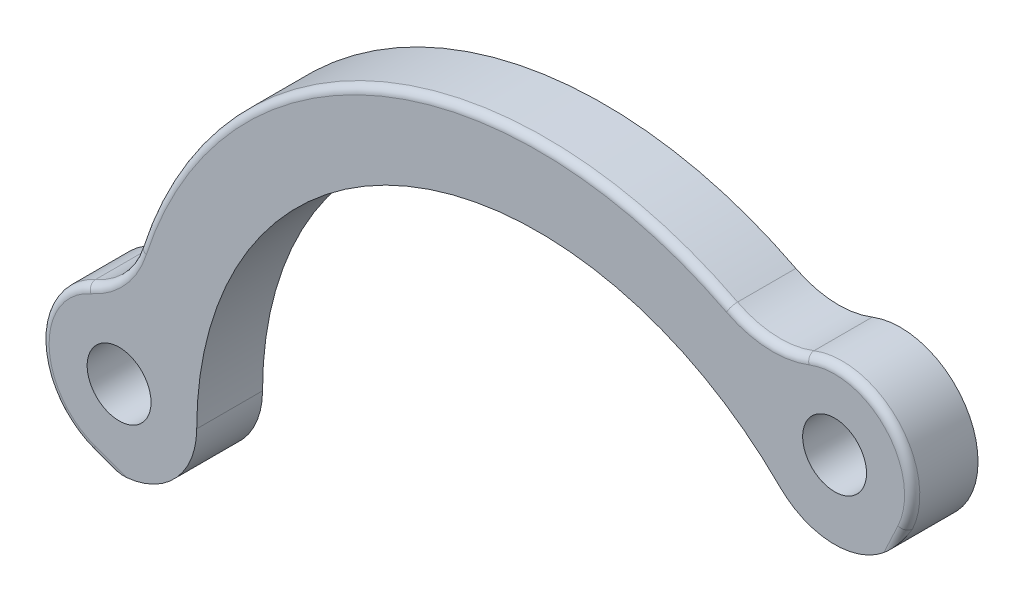
ISO-10303-21;
HEADER;
FILE_DESCRIPTION(('STEP AP214'),'2;1');
FILE_NAME('part.step','',(''),(''),'','','');
FILE_SCHEMA(('AUTOMOTIVE_DESIGN { 1 0 10303 214 1 1 1 1 }'));
ENDSEC;
DATA;
#1=APPLICATION_CONTEXT('core data for automotive mechanical design processes');
#2=APPLICATION_PROTOCOL_DEFINITION('international standard','automotive_design',2000,#1);
#3=PRODUCT_CONTEXT('',#1,'mechanical');
#4=PRODUCT('Part','Part','',(#3));
#5=PRODUCT_RELATED_PRODUCT_CATEGORY('part','',(#4));
#6=PRODUCT_DEFINITION_FORMATION('','',#4);
#7=PRODUCT_DEFINITION_CONTEXT('part definition',#1,'design');
#8=PRODUCT_DEFINITION('design','',#6,#7);
#9=PRODUCT_DEFINITION_SHAPE('','',#8);
#10=(LENGTH_UNIT() NAMED_UNIT(*) SI_UNIT(.MILLI.,.METRE.));
#11=(NAMED_UNIT(*) PLANE_ANGLE_UNIT() SI_UNIT($,.RADIAN.));
#12=(NAMED_UNIT(*) SI_UNIT($,.STERADIAN.) SOLID_ANGLE_UNIT());
#13=UNCERTAINTY_MEASURE_WITH_UNIT(LENGTH_MEASURE(1.E-05),#10,'distance_accuracy_value','');
#14=(GEOMETRIC_REPRESENTATION_CONTEXT(3) GLOBAL_UNCERTAINTY_ASSIGNED_CONTEXT((#13)) GLOBAL_UNIT_ASSIGNED_CONTEXT((#10,
#11,#12)) REPRESENTATION_CONTEXT('',''));
#15=CARTESIAN_POINT('',(0.,0.,0.));
#16=DIRECTION('',(0.,0.,1.));
#17=DIRECTION('',(1.,0.,0.));
#18=AXIS2_PLACEMENT_3D('',#15,#16,#17);
#19=CARTESIAN_POINT('',(42.8625,0.,6.731));
#20=DIRECTION('',(0.,0.,1.));
#21=DIRECTION('',(1.,0.,0.));
#22=AXIS2_PLACEMENT_3D('',#19,#20,#21);
#23=PLANE('',#22);
#24=CARTESIAN_POINT('',(0.,0.,6.731));
#25=DIRECTION('',(0.,0.,1.));
#26=DIRECTION('',(1.,0.,0.));
#27=AXIS2_PLACEMENT_3D('',#24,#25,#26);
#28=CIRCLE('',#27,7.9375);
#29=CARTESIAN_POINT('',(7.9375,0.,6.731));
#30=VERTEX_POINT('',#29);
#31=CARTESIAN_POINT('',(0.776396496338485,-7.89943762115211,6.731));
#32=VERTEX_POINT('',#31);
#33=EDGE_CURVE('E55',#30,#32,#28,.F.);
#34=ORIENTED_EDGE('',*,*,#33,.F.);
#35=CARTESIAN_POINT('',(42.8625,0.,6.731));
#36=DIRECTION('',(0.,0.,1.));
#37=DIRECTION('',(1.,0.,0.));
#38=AXIS2_PLACEMENT_3D('',#35,#36,#37);
#39=CIRCLE('',#38,34.925);
#40=CARTESIAN_POINT('',(67.5582043329403,24.69570433294,6.731));
#41=VERTEX_POINT('',#40);
#42=EDGE_CURVE('E140',#41,#30,#39,.T.);
#43=ORIENTED_EDGE('',*,*,#42,.F.);
#44=CARTESIAN_POINT('',(73.1708644086086,30.3083644086082,6.731));
#45=DIRECTION('',(0.,0.,1.));
#46=DIRECTION('',(1.,0.,0.));
#47=AXIS2_PLACEMENT_3D('',#44,#45,#46);
#48=CIRCLE('',#47,7.93750000000001);
#49=CARTESIAN_POINT('',(78.2076150906349,24.173623271681,6.731));
#50=VERTEX_POINT('',#49);
#51=EDGE_CURVE('E157',#50,#41,#48,.F.);
#52=ORIENTED_EDGE('',*,*,#51,.F.);
#53=DIRECTION('',(0.422618261740707,0.906307787036646,0.));
#54=VECTOR('',#53,1.);
#55=CARTESIAN_POINT('',(79.6577623943234,27.2834742001991,6.731));
#56=LINE('',#55,#54);
#57=CARTESIAN_POINT('',(79.6577623943234,27.2834742001991,6.731));
#58=VERTEX_POINT('',#57);
#59=EDGE_CURVE('E271',#50,#58,#56,.T.);
#60=ORIENTED_EDGE('',*,*,#59,.T.);
#61=CARTESIAN_POINT('',(73.1708644086086,30.3083644086082,6.731));
#62=DIRECTION('',(0.,0.,1.));
#63=DIRECTION('',(1.,0.,0.));
#64=AXIS2_PLACEMENT_3D('',#61,#62,#63);
#65=CIRCLE('',#64,7.15750000000002);
#66=CARTESIAN_POINT('',(70.5738738556035,36.9781055068521,6.731));
#67=VERTEX_POINT('',#66);
#68=EDGE_CURVE('E230',#58,#67,#65,.T.);
#69=ORIENTED_EDGE('',*,*,#68,.T.);
#70=CARTESIAN_POINT('',(66.834860562035,46.5808553521056,6.731));
#71=DIRECTION('',(0.,0.,1.));
#72=DIRECTION('',(1.,0.,0.));
#73=AXIS2_PLACEMENT_3D('',#70,#71,#72);
#74=CIRCLE('',#73,10.305);
#75=CARTESIAN_POINT('',(62.1193239246354,37.4180643350987,6.731));
#76=VERTEX_POINT('',#75);
#77=EDGE_CURVE('E268',#67,#76,#74,.F.);
#78=ORIENTED_EDGE('',*,*,#77,.T.);
#79=CARTESIAN_POINT('',(42.8625,0.,6.731));
#80=DIRECTION('',(0.,0.,1.));
#81=DIRECTION('',(1.,0.,0.));
#82=AXIS2_PLACEMENT_3D('',#79,#80,#81);
#83=CIRCLE('',#82,42.0825);
#84=CARTESIAN_POINT('',(2.78730218855219,12.841936248998,6.731));
#85=VERTEX_POINT('',#84);
#86=EDGE_CURVE('E266',#76,#85,#83,.T.);
#87=ORIENTED_EDGE('',*,*,#86,.T.);
#88=CARTESIAN_POINT('',(-7.0261574074074,15.9866199784799,6.731));
#89=DIRECTION('',(0.,0.,1.));
#90=DIRECTION('',(1.,0.,0.));
#91=AXIS2_PLACEMENT_3D('',#88,#89,#90);
#92=CIRCLE('',#91,10.305);
#93=CARTESIAN_POINT('',(-2.87986952861953,6.55256879003408,6.731));
#94=VERTEX_POINT('',#93);
#95=EDGE_CURVE('E264',#85,#94,#92,.F.);
#96=ORIENTED_EDGE('',*,*,#95,.T.);
#97=CARTESIAN_POINT('',(0.,0.,6.731));
#98=DIRECTION('',(0.,0.,1.));
#99=DIRECTION('',(1.,0.,0.));
#100=AXIS2_PLACEMENT_3D('',#97,#98,#99);
#101=CIRCLE('',#100,7.1575);
#102=CARTESIAN_POINT('',(-2.44800917585345,-6.72584993327515,6.731));
#103=VERTEX_POINT('',#102);
#104=EDGE_CURVE('E262',#94,#103,#101,.T.);
#105=ORIENTED_EDGE('',*,*,#104,.T.);
#106=DIRECTION('',(0.939692620785909,-0.342020143325666,0.));
#107=VECTOR('',#106,1.);
#108=CARTESIAN_POINT('',(15.8872000053329,-13.3993203142713,6.731));
#109=LINE('',#108,#107);
#110=EDGE_CURVE('E259',#103,#32,#109,.T.);
#111=ORIENTED_EDGE('',*,*,#110,.T.);
#112=EDGE_LOOP('',(#34,#43,#52,#60,#69,#78,#87,#96,#105,#111));
#113=FACE_BOUND('',#112,.T.);
#114=CARTESIAN_POINT('',(0.,0.,6.731));
#115=DIRECTION('',(0.,0.,1.));
#116=DIRECTION('',(1.,0.,0.));
#117=AXIS2_PLACEMENT_3D('',#114,#115,#116);
#118=CIRCLE('',#117,3.2639);
#119=CARTESIAN_POINT('',(3.2639,0.,6.731));
#120=VERTEX_POINT('',#119);
#121=EDGE_CURVE('E232',#120,#120,#118,.T.);
#122=ORIENTED_EDGE('',*,*,#121,.F.);
#123=EDGE_LOOP('',(#122));
#124=FACE_BOUND('',#123,.T.);
#125=CARTESIAN_POINT('',(73.1708644086086,30.3083644086082,6.731));
#126=DIRECTION('',(0.,0.,1.));
#127=DIRECTION('',(1.,0.,0.));
#128=AXIS2_PLACEMENT_3D('',#125,#126,#127);
#129=CIRCLE('',#128,3.2639);
#130=CARTESIAN_POINT('',(76.4347644086086,30.3083644086082,6.731));
#131=VERTEX_POINT('',#130);
#132=EDGE_CURVE('E290',#131,#131,#129,.T.);
#133=ORIENTED_EDGE('',*,*,#132,.F.);
#134=EDGE_LOOP('',(#133));
#135=FACE_BOUND('',#134,.T.);
#136=ADVANCED_FACE('F35',(#113,#124,#135),#23,.T.);
#137=CARTESIAN_POINT('',(42.8625,0.,0.));
#138=DIRECTION('',(0.,0.,1.));
#139=DIRECTION('',(1.,0.,0.));
#140=AXIS2_PLACEMENT_3D('',#137,#138,#139);
#141=PLANE('',#140);
#142=CARTESIAN_POINT('',(0.,0.,0.));
#143=DIRECTION('',(0.,0.,1.));
#144=DIRECTION('',(1.,0.,0.));
#145=AXIS2_PLACEMENT_3D('',#142,#143,#144);
#146=CIRCLE('',#145,3.2639);
#147=CARTESIAN_POINT('',(3.2639,0.,0.));
#148=VERTEX_POINT('',#147);
#149=EDGE_CURVE('E235',#148,#148,#146,.T.);
#150=ORIENTED_EDGE('',*,*,#149,.T.);
#151=EDGE_LOOP('',(#150));
#152=FACE_BOUND('',#151,.T.);
#153=CARTESIAN_POINT('',(73.1708644086086,30.3083644086082,0.));
#154=DIRECTION('',(0.,0.,1.));
#155=DIRECTION('',(1.,0.,0.));
#156=AXIS2_PLACEMENT_3D('',#153,#154,#155);
#157=CIRCLE('',#156,3.2639);
#158=CARTESIAN_POINT('',(76.4347644086086,30.3083644086082,0.));
#159=VERTEX_POINT('',#158);
#160=EDGE_CURVE('E287',#159,#159,#157,.T.);
#161=ORIENTED_EDGE('',*,*,#160,.T.);
#162=EDGE_LOOP('',(#161));
#163=FACE_BOUND('',#162,.T.);
#164=CARTESIAN_POINT('',(42.8625,0.,0.));
#165=DIRECTION('',(0.,0.,-1.));
#166=DIRECTION('',(-1.,0.,0.));
#167=AXIS2_PLACEMENT_3D('',#164,#165,#166);
#168=CIRCLE('',#167,34.925);
#169=CARTESIAN_POINT('',(7.9375,0.,0.));
#170=VERTEX_POINT('',#169);
#171=CARTESIAN_POINT('',(67.5582043329403,24.69570433294,0.));
#172=VERTEX_POINT('',#171);
#173=EDGE_CURVE('E138',#170,#172,#168,.T.);
#174=ORIENTED_EDGE('',*,*,#173,.F.);
#175=CARTESIAN_POINT('',(0.,0.,0.));
#176=DIRECTION('',(0.,0.,1.));
#177=DIRECTION('',(-1.,0.,0.));
#178=AXIS2_PLACEMENT_3D('',#175,#176,#177);
#179=CIRCLE('',#178,7.9375);
#180=CARTESIAN_POINT('',(-3.19370791245791,7.26664544476361,0.));
#181=VERTEX_POINT('',#180);
#182=EDGE_CURVE('E122',#181,#170,#179,.T.);
#183=ORIENTED_EDGE('',*,*,#182,.F.);
#184=CARTESIAN_POINT('',(-7.0261574074074,15.9866199784799,0.));
#185=DIRECTION('',(0.,0.,1.));
#186=DIRECTION('',(1.,0.,0.));
#187=AXIS2_PLACEMENT_3D('',#184,#185,#186);
#188=CIRCLE('',#187,9.525);
#189=CARTESIAN_POINT('',(2.04450757575757,13.0799618005745,0.));
#190=VERTEX_POINT('',#189);
#191=EDGE_CURVE('E273',#181,#190,#188,.T.);
#192=ORIENTED_EDGE('',*,*,#191,.T.);
#193=CARTESIAN_POINT('',(42.8625,0.,0.));
#194=DIRECTION('',(0.,0.,1.));
#195=DIRECTION('',(-1.,0.,0.));
#196=AXIS2_PLACEMENT_3D('',#193,#194,#195);
#197=CIRCLE('',#196,42.8625);
#198=CARTESIAN_POINT('',(62.4762495507559,38.1116089244501,0.));
#199=VERTEX_POINT('',#198);
#200=EDGE_CURVE('E132',#199,#190,#197,.T.);
#201=ORIENTED_EDGE('',*,*,#200,.F.);
#202=CARTESIAN_POINT('',(66.834860562035,46.5808553521056,0.));
#203=DIRECTION('',(0.,0.,1.));
#204=DIRECTION('',(1.,0.,0.));
#205=AXIS2_PLACEMENT_3D('',#202,#203,#204);
#206=CIRCLE('',#205,9.525);
#207=CARTESIAN_POINT('',(70.290862660166,37.7049512011071,0.));
#208=VERTEX_POINT('',#207);
#209=EDGE_CURVE('E275',#199,#208,#206,.T.);
#210=ORIENTED_EDGE('',*,*,#209,.T.);
#211=CARTESIAN_POINT('',(73.1708644086086,30.3083644086082,0.));
#212=DIRECTION('',(0.,0.,1.));
#213=DIRECTION('',(1.,0.,0.));
#214=AXIS2_PLACEMENT_3D('',#211,#212,#213);
#215=CIRCLE('',#214,7.93750000000002);
#216=EDGE_CURVE('E145',#172,#208,#215,.T.);
#217=ORIENTED_EDGE('',*,*,#216,.F.);
#218=EDGE_LOOP('',(#174,#183,#192,#201,#210,#217));
#219=FACE_BOUND('',#218,.T.);
#220=ADVANCED_FACE('F143',(#152,#163,#219),#141,.F.);
#221=CARTESIAN_POINT('',(73.1708644086086,30.3083644086082,6.731));
#222=DIRECTION('',(0.,0.,-1.));
#223=DIRECTION('',(-1.,0.,0.));
#224=AXIS2_PLACEMENT_3D('',#221,#222,#223);
#225=CYLINDRICAL_SURFACE('',#224,7.93750000000002);
#226=DIRECTION('',(0.,0.,-1.));
#227=VECTOR('',#226,1.);
#228=CARTESIAN_POINT('',(70.290862660166,37.7049512011071,6.731));
#229=LINE('',#228,#227);
#230=CARTESIAN_POINT('',(70.290862660166,37.7049512011071,5.951));
#231=VERTEX_POINT('',#230);
#232=EDGE_CURVE('E278',#208,#231,#229,.F.);
#233=ORIENTED_EDGE('',*,*,#232,.T.);
#234=CARTESIAN_POINT('',(73.1708644086086,30.3083644086082,5.951));
#235=DIRECTION('',(0.,0.,1.));
#236=DIRECTION('',(1.,0.,0.));
#237=AXIS2_PLACEMENT_3D('',#234,#235,#236);
#238=CIRCLE('',#237,7.93750000000002);
#239=CARTESIAN_POINT('',(80.364682468212,26.9538319560414,5.951));
#240=VERTEX_POINT('',#239);
#241=EDGE_CURVE('E228',#231,#240,#238,.F.);
#242=ORIENTED_EDGE('',*,*,#241,.T.);
#243=CARTESIAN_POINT('',(78.2076150906349,24.173623271681,6.731));
#244=CARTESIAN_POINT('',(78.2568085097883,24.2140102377211,6.73098779399788));
#245=CARTESIAN_POINT('',(78.3055019851384,24.2549809086841,6.72954464634177));
#246=CARTESIAN_POINT('',(78.4017918000833,24.3379927588243,6.72414057731396));
#247=CARTESIAN_POINT('',(78.44938859964,24.3800334730438,6.72018073216149));
#248=CARTESIAN_POINT('',(78.5433389259716,24.4650407654256,6.71009655524097));
#249=CARTESIAN_POINT('',(78.5896946820609,24.5080053927864,6.70397643027504));
#250=CARTESIAN_POINT('',(78.6812187969471,24.5948818574856,6.68983911060659));
#251=CARTESIAN_POINT('',(78.726387010419,24.6387938095664,6.68182168491231));
#252=CARTESIAN_POINT('',(78.8596888846366,24.7715008857033,6.6553574886065));
#253=CARTESIAN_POINT('',(78.9460201075267,24.8616299028774,6.63445162109685));
#254=CARTESIAN_POINT('',(79.1137541511226,25.0451485852694,6.58755339415589));
#255=CARTESIAN_POINT('',(79.1951538146437,25.138540280184,6.56155782042492));
#256=CARTESIAN_POINT('',(79.3835185653492,25.3650725304306,6.49481389951718));
#257=CARTESIAN_POINT('',(79.4881797458855,25.4996029953053,6.45225050388705));
#258=CARTESIAN_POINT('',(79.6878745475092,25.773908250953,6.36200064409832));
#259=CARTESIAN_POINT('',(79.7829068933494,25.9136837330279,6.31431350306729));
#260=CARTESIAN_POINT('',(80.0537247180363,26.3405353231946,6.16640500875739));
#261=CARTESIAN_POINT('',(80.215299930851,26.6352199804813,6.06130956762044));
#262=CARTESIAN_POINT('',(80.3598865861569,26.9435615264311,5.95455324014988));
#263=CARTESIAN_POINT('',(80.3622873058438,26.9486955242317,5.95277658745562));
#264=CARTESIAN_POINT('',(80.364682468212,26.9538319560414,5.951));
#265=B_SPLINE_CURVE_WITH_KNOTS('',3,(#243,#244,#245,#246,#247,#248,#249,#250,#251,#252,#253,
#254,#255,#256,#257,#258,#259,#260,#261,#262,#263,#264),.UNSPECIFIED.,.F.,.F.,(4,2,2,2,2,2,2,2,
2,2,4),(0.,0.190901062952404,0.381720545465926,0.572170468913945,0.762643591116576,
1.14196697846495,1.52153069694039,2.04805225414019,2.5746434531931,3.62749352862365,
3.64531206767867),.UNSPECIFIED.);
#266=EDGE_CURVE('E151',#240,#50,#265,.F.);
#267=ORIENTED_EDGE('',*,*,#266,.T.);
#268=ORIENTED_EDGE('',*,*,#51,.T.);
#269=DIRECTION('',(0.,0.,-1.));
#270=VECTOR('',#269,1.);
#271=CARTESIAN_POINT('',(67.5582043329403,24.69570433294,6.79434496638833));
#272=LINE('',#271,#270);
#273=EDGE_CURVE('E141',#41,#172,#272,.T.);
#274=ORIENTED_EDGE('',*,*,#273,.T.);
#275=ORIENTED_EDGE('',*,*,#216,.T.);
#276=EDGE_LOOP('',(#233,#242,#267,#268,#274,#275));
#277=FACE_BOUND('',#276,.T.);
#278=ADVANCED_FACE('F179',(#277),#225,.T.);
#279=CARTESIAN_POINT('',(42.8625,0.,6.731));
#280=DIRECTION('',(0.,0.,-1.));
#281=DIRECTION('',(-1.,0.,0.));
#282=AXIS2_PLACEMENT_3D('',#279,#280,#281);
#283=CYLINDRICAL_SURFACE('',#282,42.8625);
#284=DIRECTION('',(0.,0.,-1.));
#285=VECTOR('',#284,1.);
#286=CARTESIAN_POINT('',(2.04450757575757,13.0799618005745,6.731));
#287=LINE('',#286,#285);
#288=CARTESIAN_POINT('',(2.04450757575757,13.0799618005745,5.951));
#289=VERTEX_POINT('',#288);
#290=EDGE_CURVE('E131',#190,#289,#287,.F.);
#291=ORIENTED_EDGE('',*,*,#290,.T.);
#292=CARTESIAN_POINT('',(42.8625,0.,5.951));
#293=DIRECTION('',(0.,0.,1.));
#294=DIRECTION('',(1.,0.,0.));
#295=AXIS2_PLACEMENT_3D('',#292,#293,#294);
#296=CIRCLE('',#295,42.8625);
#297=CARTESIAN_POINT('',(62.4762495507559,38.1116089244501,5.951));
#298=VERTEX_POINT('',#297);
#299=EDGE_CURVE('E49',#289,#298,#296,.F.);
#300=ORIENTED_EDGE('',*,*,#299,.T.);
#301=DIRECTION('',(0.,0.,-1.));
#302=VECTOR('',#301,1.);
#303=CARTESIAN_POINT('',(62.4762495507559,38.1116089244501,6.731));
#304=LINE('',#303,#302);
#305=EDGE_CURVE('E281',#298,#199,#304,.T.);
#306=ORIENTED_EDGE('',*,*,#305,.T.);
#307=ORIENTED_EDGE('',*,*,#200,.T.);
#308=EDGE_LOOP('',(#291,#300,#306,#307));
#309=FACE_BOUND('',#308,.T.);
#310=ADVANCED_FACE('F183',(#309),#283,.T.);
#311=CARTESIAN_POINT('',(0.,0.,6.731));
#312=DIRECTION('',(0.,0.,-1.));
#313=DIRECTION('',(-1.,0.,0.));
#314=AXIS2_PLACEMENT_3D('',#311,#312,#313);
#315=CYLINDRICAL_SURFACE('',#314,7.9375);
#316=ORIENTED_EDGE('',*,*,#182,.T.);
#317=DIRECTION('',(0.,0.,-1.));
#318=VECTOR('',#317,1.);
#319=CARTESIAN_POINT('',(7.9375,0.,6.79434496638833));
#320=LINE('',#319,#318);
#321=EDGE_CURVE('E125',#30,#170,#320,.T.);
#322=ORIENTED_EDGE('',*,*,#321,.F.);
#323=ORIENTED_EDGE('',*,*,#33,.T.);
#324=CARTESIAN_POINT('',(0.776396496338492,-7.89943762115211,6.731));
#325=CARTESIAN_POINT('',(0.713053598506795,-7.90566472386674,6.73098779399788));
#326=CARTESIAN_POINT('',(0.649651472619264,-7.91112557121863,6.72954464634177));
#327=CARTESIAN_POINT('',(0.522866049359317,-7.92051451017244,6.72414057731393));
#328=CARTESIAN_POINT('',(0.459482755519331,-7.92444325579118,6.72018073216145));
#329=CARTESIAN_POINT('',(0.332940609781849,-7.9307669357415,6.71009655524089));
#330=CARTESIAN_POINT('',(0.269781560946025,-7.93316482586127,6.70397643027494));
#331=CARTESIAN_POINT('',(0.143633301353345,-7.93645121082505,6.68983911060644));
#332=CARTESIAN_POINT('',(0.0806441122216462,-7.93733952177365,6.68182168491214));
#333=CARTESIAN_POINT('',(-0.107452620430064,-7.93776010752993,6.6553574886063));
#334=CARTESIAN_POINT('',(-0.23222885278904,-7.9350746614382,6.63445162109668));
#335=CARTESIAN_POINT('',(-0.48060203724492,-7.92391323630687,6.58755339415582));
#336=CARTESIAN_POINT('',(-0.604198192087369,-7.91543358958833,6.56155782042495));
#337=CARTESIAN_POINT('',(-0.897574674954269,-7.88844509184195,6.49481389951711));
#338=CARTESIAN_POINT('',(-1.06670870942743,-7.86732431833702,6.45225050388668));
#339=CARTESIAN_POINT('',(-1.40187736420696,-7.81456676034916,6.36200064409877));
#340=CARTESIAN_POINT('',(-1.56791157160165,-7.78292858530601,6.31431350306888));
#341=CARTESIAN_POINT('',(-2.06123834586975,-7.6725960516417,6.16640500875447));
#342=CARTESIAN_POINT('',(-2.38386279399793,-7.5784734608172,6.06130956760404));
#343=CARTESIAN_POINT('',(-2.70413139650115,-7.46268126718847,5.95455324014933));
#344=CARTESIAN_POINT('',(-2.70945924633098,-7.46074854769945,5.95277658745534));
#345=CARTESIAN_POINT('',(-2.71478488764737,-7.45881017748819,5.951));
#346=B_SPLINE_CURVE_WITH_KNOTS('',3,(#324,#325,#326,#327,#328,#329,#330,#331,#332,#333,#334,
#335,#336,#337,#338,#339,#340,#341,#342,#343,#344,#345),.UNSPECIFIED.,.F.,.F.,(4,2,2,2,2,2,2,2,
2,2,4),(0.,0.190901062952808,0.38172054546674,0.572170468915073,0.76264359111804,
1.14196697846562,1.52153069694039,2.04805225414007,2.5746434531927,3.62749352862351,
3.64531206767856),.UNSPECIFIED.);
#347=CARTESIAN_POINT('',(-2.71478488764747,-7.45881017748816,5.951));
#348=VERTEX_POINT('',#347);
#349=EDGE_CURVE('E11',#32,#348,#346,.T.);
#350=ORIENTED_EDGE('',*,*,#349,.T.);
#351=CARTESIAN_POINT('',(0.,0.,5.951));
#352=DIRECTION('',(0.,0.,1.));
#353=DIRECTION('',(1.,0.,0.));
#354=AXIS2_PLACEMENT_3D('',#351,#352,#353);
#355=CIRCLE('',#354,7.9375);
#356=CARTESIAN_POINT('',(-3.19370791245791,7.26664544476361,5.951));
#357=VERTEX_POINT('',#356);
#358=EDGE_CURVE('E257',#348,#357,#355,.F.);
#359=ORIENTED_EDGE('',*,*,#358,.T.);
#360=DIRECTION('',(0.,0.,-1.));
#361=VECTOR('',#360,1.);
#362=CARTESIAN_POINT('',(-3.19370791245791,7.26664544476361,6.731));
#363=LINE('',#362,#361);
#364=EDGE_CURVE('E127',#357,#181,#363,.T.);
#365=ORIENTED_EDGE('',*,*,#364,.T.);
#366=EDGE_LOOP('',(#316,#322,#323,#350,#359,#365));
#367=FACE_BOUND('',#366,.T.);
#368=ADVANCED_FACE('F124',(#367),#315,.T.);
#369=CARTESIAN_POINT('',(73.1708644086086,30.3083644086082,6.731));
#370=DIRECTION('',(0.,0.,1.));
#371=DIRECTION('',(1.,0.,0.));
#372=AXIS2_PLACEMENT_3D('',#369,#370,#371);
#373=CYLINDRICAL_SURFACE('',#372,3.2639);
#374=ORIENTED_EDGE('',*,*,#160,.F.);
#375=EDGE_LOOP('',(#374));
#376=FACE_BOUND('',#375,.T.);
#377=ORIENTED_EDGE('',*,*,#132,.T.);
#378=EDGE_LOOP('',(#377));
#379=FACE_BOUND('',#378,.T.);
#380=ADVANCED_FACE('F169',(#376,#379),#373,.F.);
#381=CARTESIAN_POINT('',(0.,0.,6.731));
#382=DIRECTION('',(0.,0.,1.));
#383=DIRECTION('',(1.,0.,0.));
#384=AXIS2_PLACEMENT_3D('',#381,#382,#383);
#385=CYLINDRICAL_SURFACE('',#384,3.2639);
#386=ORIENTED_EDGE('',*,*,#149,.F.);
#387=EDGE_LOOP('',(#386));
#388=FACE_BOUND('',#387,.T.);
#389=ORIENTED_EDGE('',*,*,#121,.T.);
#390=EDGE_LOOP('',(#389));
#391=FACE_BOUND('',#390,.T.);
#392=ADVANCED_FACE('F165',(#388,#391),#385,.F.);
#393=CARTESIAN_POINT('',(66.834860562035,46.5808553521056,6.731));
#394=DIRECTION('',(0.,0.,1.));
#395=DIRECTION('',(1.,0.,0.));
#396=AXIS2_PLACEMENT_3D('',#393,#394,#395);
#397=CYLINDRICAL_SURFACE('',#396,9.525);
#398=ORIENTED_EDGE('',*,*,#305,.F.);
#399=CARTESIAN_POINT('',(66.834860562035,46.5808553521056,5.951));
#400=DIRECTION('',(0.,0.,1.));
#401=DIRECTION('',(1.,0.,0.));
#402=AXIS2_PLACEMENT_3D('',#399,#400,#401);
#403=CIRCLE('',#402,9.525);
#404=EDGE_CURVE('E253',#298,#231,#403,.T.);
#405=ORIENTED_EDGE('',*,*,#404,.T.);
#406=ORIENTED_EDGE('',*,*,#232,.F.);
#407=ORIENTED_EDGE('',*,*,#209,.F.);
#408=EDGE_LOOP('',(#398,#405,#406,#407));
#409=FACE_BOUND('',#408,.T.);
#410=ADVANCED_FACE('F168',(#409),#397,.F.);
#411=CARTESIAN_POINT('',(-7.0261574074074,15.9866199784799,6.731));
#412=DIRECTION('',(0.,0.,1.));
#413=DIRECTION('',(1.,0.,0.));
#414=AXIS2_PLACEMENT_3D('',#411,#412,#413);
#415=CYLINDRICAL_SURFACE('',#414,9.525);
#416=ORIENTED_EDGE('',*,*,#364,.F.);
#417=CARTESIAN_POINT('',(-7.0261574074074,15.9866199784799,5.951));
#418=DIRECTION('',(0.,0.,1.));
#419=DIRECTION('',(1.,0.,0.));
#420=AXIS2_PLACEMENT_3D('',#417,#418,#419);
#421=CIRCLE('',#420,9.525);
#422=EDGE_CURVE('E255',#357,#289,#421,.T.);
#423=ORIENTED_EDGE('',*,*,#422,.T.);
#424=ORIENTED_EDGE('',*,*,#290,.F.);
#425=ORIENTED_EDGE('',*,*,#191,.F.);
#426=EDGE_LOOP('',(#416,#423,#424,#425));
#427=FACE_BOUND('',#426,.T.);
#428=ADVANCED_FACE('F191',(#427),#415,.F.);
#429=CARTESIAN_POINT('',(62.6357236782581,-9.2204056275837,5.951));
#430=DIRECTION('',(-0.422618261740707,-0.906307787036646,0.));
#431=DIRECTION('',(0.906307787036646,-0.422618261740707,0.));
#432=AXIS2_PLACEMENT_3D('',#429,#430,#431);
#433=CYLINDRICAL_SURFACE('',#432,0.78);
#434=ORIENTED_EDGE('',*,*,#266,.F.);
#435=CARTESIAN_POINT('',(79.6577623943234,27.2834742001991,5.951));
#436=DIRECTION('',(0.422618261740708,0.906307787036646,0.));
#437=DIRECTION('',(-0.906307787036646,0.422618261740708,0.));
#438=AXIS2_PLACEMENT_3D('',#435,#436,#437);
#439=CIRCLE('',#438,0.78);
#440=EDGE_CURVE('E225',#58,#240,#439,.T.);
#441=ORIENTED_EDGE('',*,*,#440,.F.);
#442=ORIENTED_EDGE('',*,*,#59,.F.);
#443=EDGE_LOOP('',(#434,#441,#442));
#444=FACE_BOUND('',#443,.T.);
#445=ADVANCED_FACE('F37',(#444),#433,.T.);
#446=CARTESIAN_POINT('',(73.1708644086086,30.3083644086082,5.951));
#447=DIRECTION('',(0.,0.,1.));
#448=DIRECTION('',(1.,0.,0.));
#449=AXIS2_PLACEMENT_3D('',#446,#447,#448);
#450=TOROIDAL_SURFACE('',#449,7.15750000000002,0.78);
#451=ORIENTED_EDGE('',*,*,#440,.T.);
#452=ORIENTED_EDGE('',*,*,#241,.F.);
#453=CARTESIAN_POINT('',(70.5738738556035,36.9781055068521,5.951));
#454=DIRECTION('',(-0.931853454173081,-0.362834865945511,0.));
#455=DIRECTION('',(0.362834865945511,-0.931853454173081,0.));
#456=AXIS2_PLACEMENT_3D('',#453,#454,#455);
#457=CIRCLE('',#456,0.78);
#458=EDGE_CURVE('E233',#67,#231,#457,.T.);
#459=ORIENTED_EDGE('',*,*,#458,.F.);
#460=ORIENTED_EDGE('',*,*,#68,.F.);
#461=EDGE_LOOP('',(#451,#452,#459,#460));
#462=FACE_BOUND('',#461,.T.);
#463=ADVANCED_FACE('F213',(#462),#450,.T.);
#464=CARTESIAN_POINT('',(66.834860562035,46.5808553521056,5.951));
#465=DIRECTION('',(0.,0.,1.));
#466=DIRECTION('',(1.,0.,0.));
#467=AXIS2_PLACEMENT_3D('',#464,#465,#466);
#468=TOROIDAL_SURFACE('',#467,10.305,0.78);
#469=ORIENTED_EDGE('',*,*,#458,.T.);
#470=ORIENTED_EDGE('',*,*,#404,.F.);
#471=CARTESIAN_POINT('',(62.1193239246354,37.4180643350987,5.951));
#472=DIRECTION('',(-0.889159729937596,0.457596956564728,0.));
#473=DIRECTION('',(-0.457596956564728,-0.889159729937596,0.));
#474=AXIS2_PLACEMENT_3D('',#471,#472,#473);
#475=CIRCLE('',#474,0.78);
#476=EDGE_CURVE('E237',#76,#298,#475,.T.);
#477=ORIENTED_EDGE('',*,*,#476,.F.);
#478=ORIENTED_EDGE('',*,*,#77,.F.);
#479=EDGE_LOOP('',(#469,#470,#477,#478));
#480=FACE_BOUND('',#479,.T.);
#481=ADVANCED_FACE('F210',(#480),#468,.T.);
#482=CARTESIAN_POINT('',(42.8625,0.,5.951));
#483=DIRECTION('',(0.,0.,1.));
#484=DIRECTION('',(1.,0.,0.));
#485=AXIS2_PLACEMENT_3D('',#482,#483,#484);
#486=TOROIDAL_SURFACE('',#485,42.0825,0.78);
#487=ORIENTED_EDGE('',*,*,#476,.T.);
#488=ORIENTED_EDGE('',*,*,#299,.F.);
#489=CARTESIAN_POINT('',(2.78730218855219,12.841936248998,5.951));
#490=DIRECTION('',(-0.305160963559628,-0.952300785634119,0.));
#491=DIRECTION('',(0.952300785634119,-0.305160963559628,0.));
#492=AXIS2_PLACEMENT_3D('',#489,#490,#491);
#493=CIRCLE('',#492,0.78);
#494=EDGE_CURVE('E242',#85,#289,#493,.T.);
#495=ORIENTED_EDGE('',*,*,#494,.F.);
#496=ORIENTED_EDGE('',*,*,#86,.F.);
#497=EDGE_LOOP('',(#487,#488,#495,#496));
#498=FACE_BOUND('',#497,.T.);
#499=ADVANCED_FACE('F206',(#498),#486,.T.);
#500=CARTESIAN_POINT('',(-7.0261574074074,15.9866199784799,5.951));
#501=DIRECTION('',(0.,0.,1.));
#502=DIRECTION('',(1.,0.,0.));
#503=AXIS2_PLACEMENT_3D('',#500,#501,#502);
#504=TOROIDAL_SURFACE('',#503,10.305,0.78);
#505=ORIENTED_EDGE('',*,*,#494,.T.);
#506=ORIENTED_EDGE('',*,*,#422,.F.);
#507=CARTESIAN_POINT('',(-2.87986952861953,6.55256879003408,5.951));
#508=DIRECTION('',(-0.91548289067888,-0.402356902356902,0.));
#509=DIRECTION('',(0.402356902356902,-0.91548289067888,0.));
#510=AXIS2_PLACEMENT_3D('',#507,#508,#509);
#511=CIRCLE('',#510,0.78);
#512=EDGE_CURVE('E245',#94,#357,#511,.T.);
#513=ORIENTED_EDGE('',*,*,#512,.F.);
#514=ORIENTED_EDGE('',*,*,#95,.F.);
#515=EDGE_LOOP('',(#505,#506,#513,#514));
#516=FACE_BOUND('',#515,.T.);
#517=ADVANCED_FACE('F202',(#516),#504,.T.);
#518=CARTESIAN_POINT('',(0.,0.,5.951));
#519=DIRECTION('',(0.,0.,1.));
#520=DIRECTION('',(1.,0.,0.));
#521=AXIS2_PLACEMENT_3D('',#518,#519,#520);
#522=TOROIDAL_SURFACE('',#521,7.1575,0.78);
#523=ORIENTED_EDGE('',*,*,#512,.T.);
#524=ORIENTED_EDGE('',*,*,#358,.F.);
#525=CARTESIAN_POINT('',(-2.44800917585345,-6.72584993327515,5.951));
#526=DIRECTION('',(0.939692620785909,-0.342020143325666,0.));
#527=DIRECTION('',(0.342020143325666,0.939692620785909,0.));
#528=AXIS2_PLACEMENT_3D('',#525,#526,#527);
#529=CIRCLE('',#528,0.78);
#530=EDGE_CURVE('E248',#103,#348,#529,.T.);
#531=ORIENTED_EDGE('',*,*,#530,.F.);
#532=ORIENTED_EDGE('',*,*,#104,.F.);
#533=EDGE_LOOP('',(#523,#524,#531,#532));
#534=FACE_BOUND('',#533,.T.);
#535=ADVANCED_FACE('F198',(#534),#522,.T.);
#536=CARTESIAN_POINT('',(35.4005307957402,-20.5015918933697,5.951));
#537=DIRECTION('',(-0.939692620785909,0.342020143325666,0.));
#538=DIRECTION('',(-0.342020143325666,-0.939692620785909,0.));
#539=AXIS2_PLACEMENT_3D('',#536,#537,#538);
#540=CYLINDRICAL_SURFACE('',#539,0.78);
#541=ORIENTED_EDGE('',*,*,#349,.F.);
#542=ORIENTED_EDGE('',*,*,#110,.F.);
#543=ORIENTED_EDGE('',*,*,#530,.T.);
#544=EDGE_LOOP('',(#541,#542,#543));
#545=FACE_BOUND('',#544,.T.);
#546=ADVANCED_FACE('F162',(#545),#540,.T.);
#547=CARTESIAN_POINT('',(42.8625,0.,6.79434496638833));
#548=DIRECTION('',(0.,0.,-1.));
#549=DIRECTION('',(-1.,0.,0.));
#550=AXIS2_PLACEMENT_3D('',#547,#548,#549);
#551=CYLINDRICAL_SURFACE('',#550,34.925);
#552=ORIENTED_EDGE('',*,*,#42,.T.);
#553=ORIENTED_EDGE('',*,*,#321,.T.);
#554=ORIENTED_EDGE('',*,*,#173,.T.);
#555=ORIENTED_EDGE('',*,*,#273,.F.);
#556=EDGE_LOOP('',(#552,#553,#554,#555));
#557=FACE_BOUND('',#556,.T.);
#558=ADVANCED_FACE('F136',(#557),#551,.F.);
#559=CLOSED_SHELL('',(#136,#220,#278,#310,#368,#380,#392,#410,#428,#445,#463,#481,#499,#517,
#535,#546,#558));
#560=MANIFOLD_SOLID_BREP('B2',#559);
#561=ADVANCED_BREP_SHAPE_REPRESENTATION('',(#18,#560),#14);
#562=SHAPE_DEFINITION_REPRESENTATION(#9,#561);
ENDSEC;
END-ISO-10303-21;
